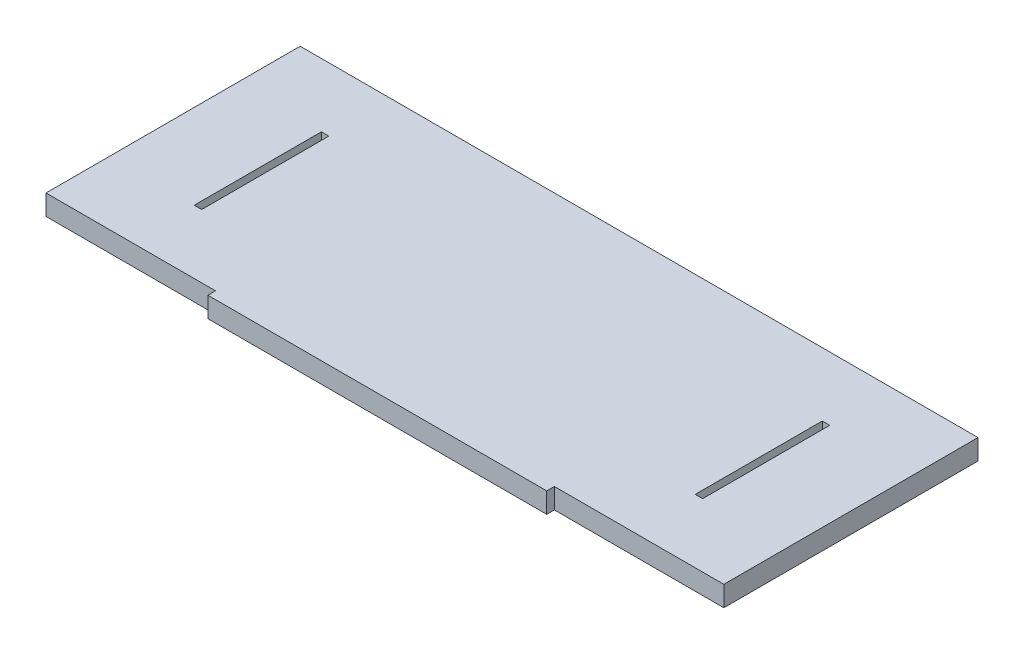
ISO-10303-21;
HEADER;
FILE_DESCRIPTION(('STEP AP214'),'2;1');
FILE_NAME('part.step','',(''),(''),'','','');
FILE_SCHEMA(('AUTOMOTIVE_DESIGN { 1 0 10303 214 1 1 1 1 }'));
ENDSEC;
DATA;
#1=APPLICATION_CONTEXT('core data for automotive mechanical design processes');
#2=APPLICATION_PROTOCOL_DEFINITION('international standard','automotive_design',2000,#1);
#3=PRODUCT_CONTEXT('',#1,'mechanical');
#4=PRODUCT('Part','Part','',(#3));
#5=PRODUCT_RELATED_PRODUCT_CATEGORY('part','',(#4));
#6=PRODUCT_DEFINITION_FORMATION('','',#4);
#7=PRODUCT_DEFINITION_CONTEXT('part definition',#1,'design');
#8=PRODUCT_DEFINITION('design','',#6,#7);
#9=PRODUCT_DEFINITION_SHAPE('','',#8);
#10=(LENGTH_UNIT() NAMED_UNIT(*) SI_UNIT(.MILLI.,.METRE.));
#11=(NAMED_UNIT(*) PLANE_ANGLE_UNIT() SI_UNIT($,.RADIAN.));
#12=(NAMED_UNIT(*) SI_UNIT($,.STERADIAN.) SOLID_ANGLE_UNIT());
#13=UNCERTAINTY_MEASURE_WITH_UNIT(LENGTH_MEASURE(1.E-05),#10,'distance_accuracy_value','');
#14=(GEOMETRIC_REPRESENTATION_CONTEXT(3) GLOBAL_UNCERTAINTY_ASSIGNED_CONTEXT((#13)) GLOBAL_UNIT_ASSIGNED_CONTEXT((#10,
#11,#12)) REPRESENTATION_CONTEXT('',''));
#15=CARTESIAN_POINT('',(0.,0.,0.));
#16=DIRECTION('',(0.,0.,1.));
#17=DIRECTION('',(1.,0.,0.));
#18=AXIS2_PLACEMENT_3D('',#15,#16,#17);
#19=CARTESIAN_POINT('',(0.,12.,75.));
#20=DIRECTION('',(0.,0.,-1.));
#21=DIRECTION('',(-1.,0.,0.));
#22=AXIS2_PLACEMENT_3D('',#19,#20,#21);
#23=PLANE('',#22);
#24=DIRECTION('',(1.,0.,0.));
#25=VECTOR('',#24,1.);
#26=CARTESIAN_POINT('',(0.,0.,75.));
#27=LINE('',#26,#25);
#28=CARTESIAN_POINT('',(-200.,0.,75.));
#29=VERTEX_POINT('',#28);
#30=CARTESIAN_POINT('',(-100.,0.,75.));
#31=VERTEX_POINT('',#30);
#32=EDGE_CURVE('E273',#29,#31,#27,.T.);
#33=ORIENTED_EDGE('',*,*,#32,.T.);
#34=DIRECTION('',(0.,-1.,0.));
#35=VECTOR('',#34,1.);
#36=CARTESIAN_POINT('',(-100.,12.,75.));
#37=LINE('',#36,#35);
#38=CARTESIAN_POINT('',(-100.,12.,75.));
#39=VERTEX_POINT('',#38);
#40=EDGE_CURVE('E12',#39,#31,#37,.T.);
#41=ORIENTED_EDGE('',*,*,#40,.F.);
#42=DIRECTION('',(1.,0.,0.));
#43=VECTOR('',#42,1.);
#44=CARTESIAN_POINT('',(0.,12.,75.));
#45=LINE('',#44,#43);
#46=CARTESIAN_POINT('',(-200.,12.,75.));
#47=VERTEX_POINT('',#46);
#48=EDGE_CURVE('E239',#47,#39,#45,.T.);
#49=ORIENTED_EDGE('',*,*,#48,.F.);
#50=DIRECTION('',(0.,-1.,0.));
#51=VECTOR('',#50,1.);
#52=CARTESIAN_POINT('',(-200.,12.,75.));
#53=LINE('',#52,#51);
#54=EDGE_CURVE('E272',#47,#29,#53,.T.);
#55=ORIENTED_EDGE('',*,*,#54,.T.);
#56=EDGE_LOOP('',(#33,#41,#49,#55));
#57=FACE_BOUND('',#56,.T.);
#58=ADVANCED_FACE('F47',(#57),#23,.F.);
#59=CARTESIAN_POINT('',(-100.,12.,0.));
#60=DIRECTION('',(1.,0.,0.));
#61=DIRECTION('',(0.,0.,-1.));
#62=AXIS2_PLACEMENT_3D('',#59,#60,#61);
#63=PLANE('',#62);
#64=DIRECTION('',(0.,0.,1.));
#65=VECTOR('',#64,1.);
#66=CARTESIAN_POINT('',(-100.,0.,0.));
#67=LINE('',#66,#65);
#68=CARTESIAN_POINT('',(-100.,0.,79.5));
#69=VERTEX_POINT('',#68);
#70=EDGE_CURVE('E277',#31,#69,#67,.T.);
#71=ORIENTED_EDGE('',*,*,#70,.T.);
#72=DIRECTION('',(0.,-1.,0.));
#73=VECTOR('',#72,1.);
#74=CARTESIAN_POINT('',(-100.,12.,79.5));
#75=LINE('',#74,#73);
#76=CARTESIAN_POINT('',(-100.,12.,79.5));
#77=VERTEX_POINT('',#76);
#78=EDGE_CURVE('E56',#77,#69,#75,.T.);
#79=ORIENTED_EDGE('',*,*,#78,.F.);
#80=DIRECTION('',(0.,0.,1.));
#81=VECTOR('',#80,1.);
#82=CARTESIAN_POINT('',(-100.,12.,0.));
#83=LINE('',#82,#81);
#84=EDGE_CURVE('E244',#39,#77,#83,.T.);
#85=ORIENTED_EDGE('',*,*,#84,.F.);
#86=ORIENTED_EDGE('',*,*,#40,.T.);
#87=EDGE_LOOP('',(#71,#79,#85,#86));
#88=FACE_BOUND('',#87,.T.);
#89=ADVANCED_FACE('F49',(#88),#63,.F.);
#90=CARTESIAN_POINT('',(0.,12.,79.5));
#91=DIRECTION('',(0.,0.,-1.));
#92=DIRECTION('',(-1.,0.,0.));
#93=AXIS2_PLACEMENT_3D('',#90,#91,#92);
#94=PLANE('',#93);
#95=DIRECTION('',(1.,0.,0.));
#96=VECTOR('',#95,1.);
#97=CARTESIAN_POINT('',(0.,0.,79.5));
#98=LINE('',#97,#96);
#99=CARTESIAN_POINT('',(99.9999999999998,0.,79.5));
#100=VERTEX_POINT('',#99);
#101=EDGE_CURVE('E281',#69,#100,#98,.T.);
#102=ORIENTED_EDGE('',*,*,#101,.T.);
#103=DIRECTION('',(0.,-1.,0.));
#104=VECTOR('',#103,1.);
#105=CARTESIAN_POINT('',(99.9999999999998,12.,79.5));
#106=LINE('',#105,#104);
#107=CARTESIAN_POINT('',(99.9999999999998,12.,79.5));
#108=VERTEX_POINT('',#107);
#109=EDGE_CURVE('E314',#108,#100,#106,.T.);
#110=ORIENTED_EDGE('',*,*,#109,.F.);
#111=DIRECTION('',(1.,0.,0.));
#112=VECTOR('',#111,1.);
#113=CARTESIAN_POINT('',(0.,12.,79.5));
#114=LINE('',#113,#112);
#115=EDGE_CURVE('E324',#77,#108,#114,.T.);
#116=ORIENTED_EDGE('',*,*,#115,.F.);
#117=ORIENTED_EDGE('',*,*,#78,.T.);
#118=EDGE_LOOP('',(#102,#110,#116,#117));
#119=FACE_BOUND('',#118,.T.);
#120=ADVANCED_FACE('F322',(#119),#94,.F.);
#121=CARTESIAN_POINT('',(99.9999999999998,12.,0.));
#122=DIRECTION('',(1.,0.,0.));
#123=DIRECTION('',(0.,0.,-1.));
#124=AXIS2_PLACEMENT_3D('',#121,#122,#123);
#125=PLANE('',#124);
#126=DIRECTION('',(0.,0.,1.));
#127=VECTOR('',#126,1.);
#128=CARTESIAN_POINT('',(99.9999999999998,0.,0.));
#129=LINE('',#128,#127);
#130=CARTESIAN_POINT('',(99.9999999999998,0.,75.));
#131=VERTEX_POINT('',#130);
#132=EDGE_CURVE('E285',#131,#100,#129,.T.);
#133=ORIENTED_EDGE('',*,*,#132,.F.);
#134=DIRECTION('',(0.,-1.,0.));
#135=VECTOR('',#134,1.);
#136=CARTESIAN_POINT('',(99.9999999999998,12.,75.));
#137=LINE('',#136,#135);
#138=CARTESIAN_POINT('',(99.9999999999998,12.,75.));
#139=VERTEX_POINT('',#138);
#140=EDGE_CURVE('E311',#139,#131,#137,.T.);
#141=ORIENTED_EDGE('',*,*,#140,.F.);
#142=DIRECTION('',(0.,0.,1.));
#143=VECTOR('',#142,1.);
#144=CARTESIAN_POINT('',(99.9999999999998,12.,0.));
#145=LINE('',#144,#143);
#146=EDGE_CURVE('E263',#139,#108,#145,.T.);
#147=ORIENTED_EDGE('',*,*,#146,.T.);
#148=ORIENTED_EDGE('',*,*,#109,.T.);
#149=EDGE_LOOP('',(#133,#141,#147,#148));
#150=FACE_BOUND('',#149,.T.);
#151=ADVANCED_FACE('F333',(#150),#125,.T.);
#152=CARTESIAN_POINT('',(200.,0.,75.));
#153=VERTEX_POINT('',#152);
#154=EDGE_CURVE('E278',#131,#153,#27,.T.);
#155=ORIENTED_EDGE('',*,*,#154,.T.);
#156=DIRECTION('',(0.,-1.,0.));
#157=VECTOR('',#156,1.);
#158=CARTESIAN_POINT('',(200.,12.,75.));
#159=LINE('',#158,#157);
#160=CARTESIAN_POINT('',(200.,12.,75.));
#161=VERTEX_POINT('',#160);
#162=EDGE_CURVE('E308',#161,#153,#159,.T.);
#163=ORIENTED_EDGE('',*,*,#162,.F.);
#164=EDGE_CURVE('E246',#139,#161,#45,.T.);
#165=ORIENTED_EDGE('',*,*,#164,.F.);
#166=ORIENTED_EDGE('',*,*,#140,.T.);
#167=EDGE_LOOP('',(#155,#163,#165,#166));
#168=FACE_BOUND('',#167,.T.);
#169=ADVANCED_FACE('F360',(#168),#23,.F.);
#170=CARTESIAN_POINT('',(200.,12.,0.));
#171=DIRECTION('',(1.,0.,0.));
#172=DIRECTION('',(0.,0.,-1.));
#173=AXIS2_PLACEMENT_3D('',#170,#171,#172);
#174=PLANE('',#173);
#175=DIRECTION('',(0.,0.,1.));
#176=VECTOR('',#175,1.);
#177=CARTESIAN_POINT('',(200.,0.,0.));
#178=LINE('',#177,#176);
#179=CARTESIAN_POINT('',(200.,0.,-75.));
#180=VERTEX_POINT('',#179);
#181=EDGE_CURVE('E289',#180,#153,#178,.T.);
#182=ORIENTED_EDGE('',*,*,#181,.F.);
#183=DIRECTION('',(0.,-1.,0.));
#184=VECTOR('',#183,1.);
#185=CARTESIAN_POINT('',(200.,12.,-75.));
#186=LINE('',#185,#184);
#187=CARTESIAN_POINT('',(200.,12.,-75.));
#188=VERTEX_POINT('',#187);
#189=EDGE_CURVE('E305',#188,#180,#186,.T.);
#190=ORIENTED_EDGE('',*,*,#189,.F.);
#191=DIRECTION('',(0.,0.,1.));
#192=VECTOR('',#191,1.);
#193=CARTESIAN_POINT('',(200.,12.,0.));
#194=LINE('',#193,#192);
#195=EDGE_CURVE('E258',#188,#161,#194,.T.);
#196=ORIENTED_EDGE('',*,*,#195,.T.);
#197=ORIENTED_EDGE('',*,*,#162,.T.);
#198=EDGE_LOOP('',(#182,#190,#196,#197));
#199=FACE_BOUND('',#198,.T.);
#200=ADVANCED_FACE('F357',(#199),#174,.T.);
#201=CARTESIAN_POINT('',(0.,12.,-75.));
#202=DIRECTION('',(0.,0.,-1.));
#203=DIRECTION('',(-1.,0.,0.));
#204=AXIS2_PLACEMENT_3D('',#201,#202,#203);
#205=PLANE('',#204);
#206=DIRECTION('',(1.,0.,0.));
#207=VECTOR('',#206,1.);
#208=CARTESIAN_POINT('',(0.,0.,-75.));
#209=LINE('',#208,#207);
#210=CARTESIAN_POINT('',(-200.,0.,-75.));
#211=VERTEX_POINT('',#210);
#212=EDGE_CURVE('E293',#211,#180,#209,.T.);
#213=ORIENTED_EDGE('',*,*,#212,.F.);
#214=DIRECTION('',(0.,-1.,0.));
#215=VECTOR('',#214,1.);
#216=CARTESIAN_POINT('',(-200.,12.,-75.));
#217=LINE('',#216,#215);
#218=CARTESIAN_POINT('',(-200.,12.,-75.));
#219=VERTEX_POINT('',#218);
#220=EDGE_CURVE('E302',#219,#211,#217,.T.);
#221=ORIENTED_EDGE('',*,*,#220,.F.);
#222=DIRECTION('',(1.,0.,0.));
#223=VECTOR('',#222,1.);
#224=CARTESIAN_POINT('',(0.,12.,-75.));
#225=LINE('',#224,#223);
#226=EDGE_CURVE('E262',#219,#188,#225,.T.);
#227=ORIENTED_EDGE('',*,*,#226,.T.);
#228=ORIENTED_EDGE('',*,*,#189,.T.);
#229=EDGE_LOOP('',(#213,#221,#227,#228));
#230=FACE_BOUND('',#229,.T.);
#231=ADVANCED_FACE('F351',(#230),#205,.T.);
#232=CARTESIAN_POINT('',(-200.,12.,0.));
#233=DIRECTION('',(1.,0.,0.));
#234=DIRECTION('',(0.,0.,-1.));
#235=AXIS2_PLACEMENT_3D('',#232,#233,#234);
#236=PLANE('',#235);
#237=DIRECTION('',(0.,0.,1.));
#238=VECTOR('',#237,1.);
#239=CARTESIAN_POINT('',(-200.,0.,0.));
#240=LINE('',#239,#238);
#241=EDGE_CURVE('E245',#211,#29,#240,.T.);
#242=ORIENTED_EDGE('',*,*,#241,.T.);
#243=ORIENTED_EDGE('',*,*,#54,.F.);
#244=DIRECTION('',(0.,0.,1.));
#245=VECTOR('',#244,1.);
#246=CARTESIAN_POINT('',(-200.,12.,0.));
#247=LINE('',#246,#245);
#248=EDGE_CURVE('E268',#219,#47,#247,.T.);
#249=ORIENTED_EDGE('',*,*,#248,.F.);
#250=ORIENTED_EDGE('',*,*,#220,.T.);
#251=EDGE_LOOP('',(#242,#243,#249,#250));
#252=FACE_BOUND('',#251,.T.);
#253=ADVANCED_FACE('F472',(#252),#236,.F.);
#254=CARTESIAN_POINT('',(0.,12.,0.));
#255=DIRECTION('',(0.,1.,0.));
#256=DIRECTION('',(0.,0.,1.));
#257=AXIS2_PLACEMENT_3D('',#254,#255,#256);
#258=PLANE('',#257);
#259=DIRECTION('',(-1.,0.,0.));
#260=VECTOR('',#259,1.);
#261=CARTESIAN_POINT('',(150.,12.,37.5));
#262=LINE('',#261,#260);
#263=CARTESIAN_POINT('',(150.,12.,37.5));
#264=VERTEX_POINT('',#263);
#265=CARTESIAN_POINT('',(145.6,12.,37.5));
#266=VERTEX_POINT('',#265);
#267=EDGE_CURVE('E163',#264,#266,#262,.T.);
#268=ORIENTED_EDGE('',*,*,#267,.T.);
#269=DIRECTION('',(0.,0.,-1.));
#270=VECTOR('',#269,1.);
#271=CARTESIAN_POINT('',(145.6,12.,37.5));
#272=LINE('',#271,#270);
#273=CARTESIAN_POINT('',(145.6,12.,-37.5));
#274=VERTEX_POINT('',#273);
#275=EDGE_CURVE('E170',#266,#274,#272,.T.);
#276=ORIENTED_EDGE('',*,*,#275,.T.);
#277=DIRECTION('',(-1.,0.,0.));
#278=VECTOR('',#277,1.);
#279=CARTESIAN_POINT('',(150.,12.,-37.5));
#280=LINE('',#279,#278);
#281=CARTESIAN_POINT('',(150.,12.,-37.5));
#282=VERTEX_POINT('',#281);
#283=EDGE_CURVE('E63',#282,#274,#280,.T.);
#284=ORIENTED_EDGE('',*,*,#283,.F.);
#285=DIRECTION('',(0.,0.,-1.));
#286=VECTOR('',#285,1.);
#287=CARTESIAN_POINT('',(150.,12.,37.5));
#288=LINE('',#287,#286);
#289=EDGE_CURVE('E181',#264,#282,#288,.T.);
#290=ORIENTED_EDGE('',*,*,#289,.F.);
#291=EDGE_LOOP('',(#268,#276,#284,#290));
#292=FACE_BOUND('',#291,.T.);
#293=DIRECTION('',(1.,0.,0.));
#294=VECTOR('',#293,1.);
#295=CARTESIAN_POINT('',(-150.,12.,37.5));
#296=LINE('',#295,#294);
#297=CARTESIAN_POINT('',(-150.,12.,37.5));
#298=VERTEX_POINT('',#297);
#299=CARTESIAN_POINT('',(-145.6,12.,37.5));
#300=VERTEX_POINT('',#299);
#301=EDGE_CURVE('E183',#298,#300,#296,.T.);
#302=ORIENTED_EDGE('',*,*,#301,.F.);
#303=DIRECTION('',(0.,0.,-1.));
#304=VECTOR('',#303,1.);
#305=CARTESIAN_POINT('',(-150.,12.,37.5));
#306=LINE('',#305,#304);
#307=CARTESIAN_POINT('',(-150.,12.,-37.5));
#308=VERTEX_POINT('',#307);
#309=EDGE_CURVE('E382',#298,#308,#306,.T.);
#310=ORIENTED_EDGE('',*,*,#309,.T.);
#311=DIRECTION('',(1.,0.,0.));
#312=VECTOR('',#311,1.);
#313=CARTESIAN_POINT('',(-150.,12.,-37.5));
#314=LINE('',#313,#312);
#315=CARTESIAN_POINT('',(-145.6,12.,-37.5));
#316=VERTEX_POINT('',#315);
#317=EDGE_CURVE('E231',#308,#316,#314,.T.);
#318=ORIENTED_EDGE('',*,*,#317,.T.);
#319=DIRECTION('',(0.,0.,-1.));
#320=VECTOR('',#319,1.);
#321=CARTESIAN_POINT('',(-145.6,12.,37.5));
#322=LINE('',#321,#320);
#323=EDGE_CURVE('E187',#300,#316,#322,.T.);
#324=ORIENTED_EDGE('',*,*,#323,.F.);
#325=EDGE_LOOP('',(#302,#310,#318,#324));
#326=FACE_BOUND('',#325,.T.);
#327=ORIENTED_EDGE('',*,*,#48,.T.);
#328=ORIENTED_EDGE('',*,*,#84,.T.);
#329=ORIENTED_EDGE('',*,*,#115,.T.);
#330=ORIENTED_EDGE('',*,*,#146,.F.);
#331=ORIENTED_EDGE('',*,*,#164,.T.);
#332=ORIENTED_EDGE('',*,*,#195,.F.);
#333=ORIENTED_EDGE('',*,*,#226,.F.);
#334=ORIENTED_EDGE('',*,*,#248,.T.);
#335=EDGE_LOOP('',(#327,#328,#329,#330,#331,#332,#333,#334));
#336=FACE_BOUND('',#335,.T.);
#337=ADVANCED_FACE('F178',(#292,#326,#336),#258,.T.);
#338=CARTESIAN_POINT('',(0.,0.,0.));
#339=DIRECTION('',(0.,1.,0.));
#340=DIRECTION('',(0.,0.,1.));
#341=AXIS2_PLACEMENT_3D('',#338,#339,#340);
#342=PLANE('',#341);
#343=DIRECTION('',(0.,0.,1.));
#344=VECTOR('',#343,1.);
#345=CARTESIAN_POINT('',(145.6,0.,37.5));
#346=LINE('',#345,#344);
#347=CARTESIAN_POINT('',(145.6,0.,-37.5));
#348=VERTEX_POINT('',#347);
#349=CARTESIAN_POINT('',(145.6,0.,37.5));
#350=VERTEX_POINT('',#349);
#351=EDGE_CURVE('E176',#348,#350,#346,.T.);
#352=ORIENTED_EDGE('',*,*,#351,.T.);
#353=DIRECTION('',(1.,0.,0.));
#354=VECTOR('',#353,1.);
#355=CARTESIAN_POINT('',(150.,0.,37.5));
#356=LINE('',#355,#354);
#357=CARTESIAN_POINT('',(150.,0.,37.5));
#358=VERTEX_POINT('',#357);
#359=EDGE_CURVE('E71',#350,#358,#356,.T.);
#360=ORIENTED_EDGE('',*,*,#359,.T.);
#361=DIRECTION('',(0.,0.,1.));
#362=VECTOR('',#361,1.);
#363=CARTESIAN_POINT('',(150.,0.,37.5));
#364=LINE('',#363,#362);
#365=CARTESIAN_POINT('',(150.,0.,-37.5));
#366=VERTEX_POINT('',#365);
#367=EDGE_CURVE('E189',#366,#358,#364,.T.);
#368=ORIENTED_EDGE('',*,*,#367,.F.);
#369=DIRECTION('',(1.,0.,0.));
#370=VECTOR('',#369,1.);
#371=CARTESIAN_POINT('',(150.,0.,-37.5));
#372=LINE('',#371,#370);
#373=EDGE_CURVE('E211',#348,#366,#372,.T.);
#374=ORIENTED_EDGE('',*,*,#373,.F.);
#375=EDGE_LOOP('',(#352,#360,#368,#374));
#376=FACE_BOUND('',#375,.T.);
#377=DIRECTION('',(0.,0.,1.));
#378=VECTOR('',#377,1.);
#379=CARTESIAN_POINT('',(-150.,0.,37.5));
#380=LINE('',#379,#378);
#381=CARTESIAN_POINT('',(-150.,0.,-37.5));
#382=VERTEX_POINT('',#381);
#383=CARTESIAN_POINT('',(-150.,0.,37.5));
#384=VERTEX_POINT('',#383);
#385=EDGE_CURVE('E365',#382,#384,#380,.T.);
#386=ORIENTED_EDGE('',*,*,#385,.T.);
#387=DIRECTION('',(-1.,0.,0.));
#388=VECTOR('',#387,1.);
#389=CARTESIAN_POINT('',(-150.,0.,37.5));
#390=LINE('',#389,#388);
#391=CARTESIAN_POINT('',(-145.6,0.,37.5));
#392=VERTEX_POINT('',#391);
#393=EDGE_CURVE('E226',#392,#384,#390,.T.);
#394=ORIENTED_EDGE('',*,*,#393,.F.);
#395=DIRECTION('',(0.,0.,1.));
#396=VECTOR('',#395,1.);
#397=CARTESIAN_POINT('',(-145.6,0.,37.5));
#398=LINE('',#397,#396);
#399=CARTESIAN_POINT('',(-145.6,0.,-37.5));
#400=VERTEX_POINT('',#399);
#401=EDGE_CURVE('E247',#400,#392,#398,.T.);
#402=ORIENTED_EDGE('',*,*,#401,.F.);
#403=DIRECTION('',(-1.,0.,0.));
#404=VECTOR('',#403,1.);
#405=CARTESIAN_POINT('',(-150.,0.,-37.5));
#406=LINE('',#405,#404);
#407=EDGE_CURVE('E194',#400,#382,#406,.T.);
#408=ORIENTED_EDGE('',*,*,#407,.T.);
#409=EDGE_LOOP('',(#386,#394,#402,#408));
#410=FACE_BOUND('',#409,.T.);
#411=ORIENTED_EDGE('',*,*,#32,.F.);
#412=ORIENTED_EDGE('',*,*,#241,.F.);
#413=ORIENTED_EDGE('',*,*,#212,.T.);
#414=ORIENTED_EDGE('',*,*,#181,.T.);
#415=ORIENTED_EDGE('',*,*,#154,.F.);
#416=ORIENTED_EDGE('',*,*,#132,.T.);
#417=ORIENTED_EDGE('',*,*,#101,.F.);
#418=ORIENTED_EDGE('',*,*,#70,.F.);
#419=EDGE_LOOP('',(#411,#412,#413,#414,#415,#416,#417,#418));
#420=FACE_BOUND('',#419,.T.);
#421=ADVANCED_FACE('F328',(#376,#410,#420),#342,.F.);
#422=CARTESIAN_POINT('',(-150.,-75.128955802673,37.5));
#423=DIRECTION('',(0.,0.,1.));
#424=DIRECTION('',(1.,0.,0.));
#425=AXIS2_PLACEMENT_3D('',#422,#423,#424);
#426=PLANE('',#425);
#427=ORIENTED_EDGE('',*,*,#393,.T.);
#428=DIRECTION('',(0.,1.,0.));
#429=VECTOR('',#428,1.);
#430=CARTESIAN_POINT('',(-150.,-75.128955802673,37.5));
#431=LINE('',#430,#429);
#432=EDGE_CURVE('E370',#384,#298,#431,.T.);
#433=ORIENTED_EDGE('',*,*,#432,.T.);
#434=ORIENTED_EDGE('',*,*,#301,.T.);
#435=DIRECTION('',(0.,1.,0.));
#436=VECTOR('',#435,1.);
#437=CARTESIAN_POINT('',(-145.6,-75.128955802673,37.5));
#438=LINE('',#437,#436);
#439=EDGE_CURVE('E378',#392,#300,#438,.T.);
#440=ORIENTED_EDGE('',*,*,#439,.F.);
#441=EDGE_LOOP('',(#427,#433,#434,#440));
#442=FACE_BOUND('',#441,.T.);
#443=ADVANCED_FACE('F400',(#442),#426,.F.);
#444=CARTESIAN_POINT('',(-150.,-75.128955802673,37.5));
#445=DIRECTION('',(1.,0.,0.));
#446=DIRECTION('',(0.,0.,-1.));
#447=AXIS2_PLACEMENT_3D('',#444,#445,#446);
#448=PLANE('',#447);
#449=DIRECTION('',(0.,1.,0.));
#450=VECTOR('',#449,1.);
#451=CARTESIAN_POINT('',(-150.,-75.128955802673,-37.5));
#452=LINE('',#451,#450);
#453=EDGE_CURVE('E372',#382,#308,#452,.T.);
#454=ORIENTED_EDGE('',*,*,#453,.T.);
#455=ORIENTED_EDGE('',*,*,#309,.F.);
#456=ORIENTED_EDGE('',*,*,#432,.F.);
#457=ORIENTED_EDGE('',*,*,#385,.F.);
#458=EDGE_LOOP('',(#454,#455,#456,#457));
#459=FACE_BOUND('',#458,.T.);
#460=ADVANCED_FACE('F404',(#459),#448,.T.);
#461=CARTESIAN_POINT('',(-150.,-75.128955802673,-37.5));
#462=DIRECTION('',(0.,0.,1.));
#463=DIRECTION('',(1.,0.,0.));
#464=AXIS2_PLACEMENT_3D('',#461,#462,#463);
#465=PLANE('',#464);
#466=DIRECTION('',(0.,1.,0.));
#467=VECTOR('',#466,1.);
#468=CARTESIAN_POINT('',(-145.6,-75.128955802673,-37.5));
#469=LINE('',#468,#467);
#470=EDGE_CURVE('E375',#400,#316,#469,.T.);
#471=ORIENTED_EDGE('',*,*,#470,.T.);
#472=ORIENTED_EDGE('',*,*,#317,.F.);
#473=ORIENTED_EDGE('',*,*,#453,.F.);
#474=ORIENTED_EDGE('',*,*,#407,.F.);
#475=EDGE_LOOP('',(#471,#472,#473,#474));
#476=FACE_BOUND('',#475,.T.);
#477=ADVANCED_FACE('F392',(#476),#465,.T.);
#478=CARTESIAN_POINT('',(-145.6,-75.128955802673,37.5));
#479=DIRECTION('',(1.,0.,0.));
#480=DIRECTION('',(0.,0.,-1.));
#481=AXIS2_PLACEMENT_3D('',#478,#479,#480);
#482=PLANE('',#481);
#483=ORIENTED_EDGE('',*,*,#401,.T.);
#484=ORIENTED_EDGE('',*,*,#439,.T.);
#485=ORIENTED_EDGE('',*,*,#323,.T.);
#486=ORIENTED_EDGE('',*,*,#470,.F.);
#487=EDGE_LOOP('',(#483,#484,#485,#486));
#488=FACE_BOUND('',#487,.T.);
#489=ADVANCED_FACE('F396',(#488),#482,.F.);
#490=CARTESIAN_POINT('',(150.,-75.128955802673,37.5));
#491=DIRECTION('',(0.,0.,1.));
#492=DIRECTION('',(-1.,0.,0.));
#493=AXIS2_PLACEMENT_3D('',#490,#491,#492);
#494=PLANE('',#493);
#495=ORIENTED_EDGE('',*,*,#359,.F.);
#496=DIRECTION('',(0.,1.,0.));
#497=VECTOR('',#496,1.);
#498=CARTESIAN_POINT('',(145.6,-75.128955802673,37.5));
#499=LINE('',#498,#497);
#500=EDGE_CURVE('E159',#350,#266,#499,.T.);
#501=ORIENTED_EDGE('',*,*,#500,.T.);
#502=ORIENTED_EDGE('',*,*,#267,.F.);
#503=DIRECTION('',(0.,1.,0.));
#504=VECTOR('',#503,1.);
#505=CARTESIAN_POINT('',(150.,-75.128955802673,37.5));
#506=LINE('',#505,#504);
#507=EDGE_CURVE('E218',#358,#264,#506,.T.);
#508=ORIENTED_EDGE('',*,*,#507,.F.);
#509=EDGE_LOOP('',(#495,#501,#502,#508));
#510=FACE_BOUND('',#509,.T.);
#511=ADVANCED_FACE('F161',(#510),#494,.F.);
#512=CARTESIAN_POINT('',(150.,-75.128955802673,37.5));
#513=DIRECTION('',(-1.,0.,0.));
#514=DIRECTION('',(0.,0.,-1.));
#515=AXIS2_PLACEMENT_3D('',#512,#513,#514);
#516=PLANE('',#515);
#517=DIRECTION('',(0.,1.,0.));
#518=VECTOR('',#517,1.);
#519=CARTESIAN_POINT('',(150.,-75.128955802673,-37.5));
#520=LINE('',#519,#518);
#521=EDGE_CURVE('E208',#366,#282,#520,.T.);
#522=ORIENTED_EDGE('',*,*,#521,.F.);
#523=ORIENTED_EDGE('',*,*,#367,.T.);
#524=ORIENTED_EDGE('',*,*,#507,.T.);
#525=ORIENTED_EDGE('',*,*,#289,.T.);
#526=EDGE_LOOP('',(#522,#523,#524,#525));
#527=FACE_BOUND('',#526,.T.);
#528=ADVANCED_FACE('F531',(#527),#516,.T.);
#529=CARTESIAN_POINT('',(150.,-75.128955802673,-37.5));
#530=DIRECTION('',(0.,0.,1.));
#531=DIRECTION('',(-1.,0.,0.));
#532=AXIS2_PLACEMENT_3D('',#529,#530,#531);
#533=PLANE('',#532);
#534=DIRECTION('',(0.,1.,0.));
#535=VECTOR('',#534,1.);
#536=CARTESIAN_POINT('',(145.6,-75.128955802673,-37.5));
#537=LINE('',#536,#535);
#538=EDGE_CURVE('E169',#348,#274,#537,.T.);
#539=ORIENTED_EDGE('',*,*,#538,.F.);
#540=ORIENTED_EDGE('',*,*,#373,.T.);
#541=ORIENTED_EDGE('',*,*,#521,.T.);
#542=ORIENTED_EDGE('',*,*,#283,.T.);
#543=EDGE_LOOP('',(#539,#540,#541,#542));
#544=FACE_BOUND('',#543,.T.);
#545=ADVANCED_FACE('F539',(#544),#533,.T.);
#546=CARTESIAN_POINT('',(145.6,-75.128955802673,37.5));
#547=DIRECTION('',(-1.,0.,0.));
#548=DIRECTION('',(0.,0.,-1.));
#549=AXIS2_PLACEMENT_3D('',#546,#547,#548);
#550=PLANE('',#549);
#551=ORIENTED_EDGE('',*,*,#351,.F.);
#552=ORIENTED_EDGE('',*,*,#538,.T.);
#553=ORIENTED_EDGE('',*,*,#275,.F.);
#554=ORIENTED_EDGE('',*,*,#500,.F.);
#555=EDGE_LOOP('',(#551,#552,#553,#554));
#556=FACE_BOUND('',#555,.T.);
#557=ADVANCED_FACE('F173',(#556),#550,.F.);
#558=CLOSED_SHELL('',(#58,#89,#120,#151,#169,#200,#231,#253,#337,#421,#443,#460,#477,#489,#511,
#528,#545,#557));
#559=MANIFOLD_SOLID_BREP('B2',#558);
#560=ADVANCED_BREP_SHAPE_REPRESENTATION('',(#18,#559),#14);
#561=SHAPE_DEFINITION_REPRESENTATION(#9,#560);
ENDSEC;
END-ISO-10303-21;
